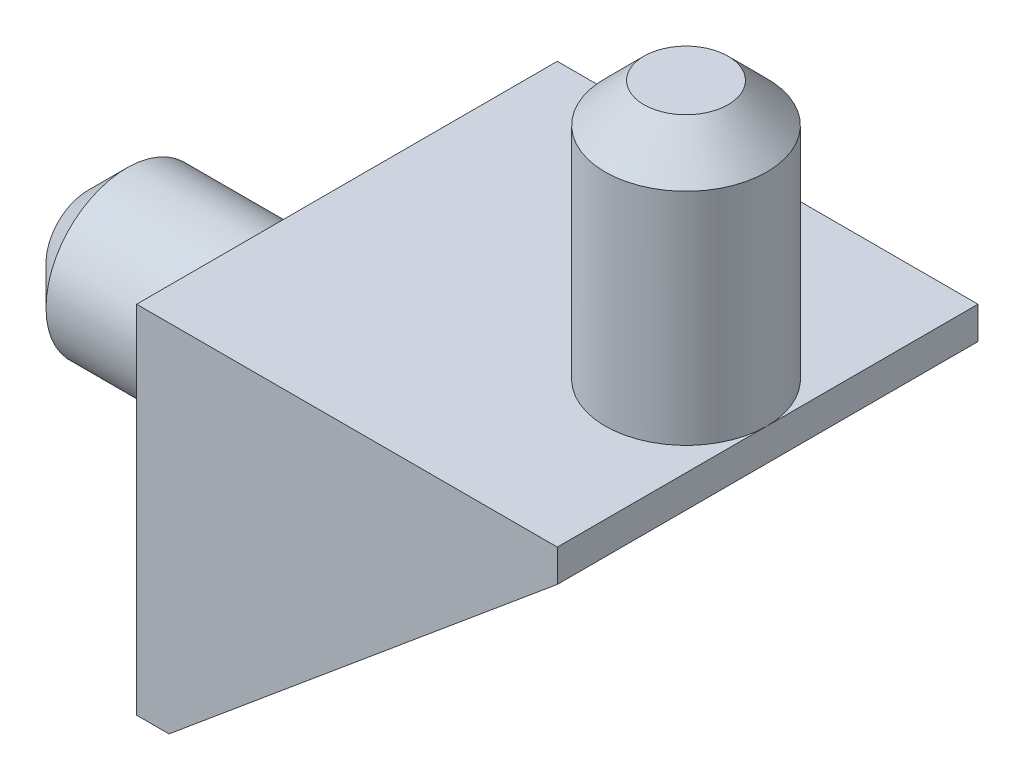
ISO-10303-21;
HEADER;
FILE_DESCRIPTION(('STEP AP214'),'2;1');
FILE_NAME('part.step','',(''),(''),'','','');
FILE_SCHEMA(('AUTOMOTIVE_DESIGN { 1 0 10303 214 1 1 1 1 }'));
ENDSEC;
DATA;
#1=APPLICATION_CONTEXT('core data for automotive mechanical design processes');
#2=APPLICATION_PROTOCOL_DEFINITION('international standard','automotive_design',2000,#1);
#3=PRODUCT_CONTEXT('',#1,'mechanical');
#4=PRODUCT('Part','Part','',(#3));
#5=PRODUCT_RELATED_PRODUCT_CATEGORY('part','',(#4));
#6=PRODUCT_DEFINITION_FORMATION('','',#4);
#7=PRODUCT_DEFINITION_CONTEXT('part definition',#1,'design');
#8=PRODUCT_DEFINITION('design','',#6,#7);
#9=PRODUCT_DEFINITION_SHAPE('','',#8);
#10=(LENGTH_UNIT() NAMED_UNIT(*) SI_UNIT(.MILLI.,.METRE.));
#11=(NAMED_UNIT(*) PLANE_ANGLE_UNIT() SI_UNIT($,.RADIAN.));
#12=(NAMED_UNIT(*) SI_UNIT($,.STERADIAN.) SOLID_ANGLE_UNIT());
#13=UNCERTAINTY_MEASURE_WITH_UNIT(LENGTH_MEASURE(1.E-05),#10,'distance_accuracy_value','');
#14=(GEOMETRIC_REPRESENTATION_CONTEXT(3) GLOBAL_UNCERTAINTY_ASSIGNED_CONTEXT((#13)) GLOBAL_UNIT_ASSIGNED_CONTEXT((#10,
#11,#12)) REPRESENTATION_CONTEXT('',''));
#15=CARTESIAN_POINT('',(0.,0.,0.));
#16=DIRECTION('',(0.,0.,1.));
#17=DIRECTION('',(1.,0.,0.));
#18=AXIS2_PLACEMENT_3D('',#15,#16,#17);
#19=CARTESIAN_POINT('',(-1.,0.,0.));
#20=DIRECTION('',(-1.,0.,0.));
#21=DIRECTION('',(0.,0.,1.));
#22=AXIS2_PLACEMENT_3D('',#19,#20,#21);
#23=PLANE('',#22);
#24=DIRECTION('',(0.,0.,-1.));
#25=VECTOR('',#24,1.);
#26=CARTESIAN_POINT('',(-1.,1.,0.));
#27=LINE('',#26,#25);
#28=CARTESIAN_POINT('',(-0.999999999999999,1.,12.));
#29=VERTEX_POINT('',#28);
#30=CARTESIAN_POINT('',(-1.,1.,-1.));
#31=VERTEX_POINT('',#30);
#32=EDGE_CURVE('E160',#29,#31,#27,.T.);
#33=ORIENTED_EDGE('',*,*,#32,.T.);
#34=DIRECTION('',(0.,1.,0.));
#35=VECTOR('',#34,1.);
#36=CARTESIAN_POINT('',(-1.,-10.,-1.));
#37=LINE('',#36,#35);
#38=CARTESIAN_POINT('',(-1.,-10.,-1.));
#39=VERTEX_POINT('',#38);
#40=EDGE_CURVE('E382',#39,#31,#37,.T.);
#41=ORIENTED_EDGE('',*,*,#40,.F.);
#42=DIRECTION('',(0.,0.,1.));
#43=VECTOR('',#42,1.);
#44=CARTESIAN_POINT('',(-1.,-10.,0.));
#45=LINE('',#44,#43);
#46=CARTESIAN_POINT('',(-0.999999999999999,-10.,12.));
#47=VERTEX_POINT('',#46);
#48=EDGE_CURVE('E158',#39,#47,#45,.T.);
#49=ORIENTED_EDGE('',*,*,#48,.T.);
#50=DIRECTION('',(0.,-1.,0.));
#51=VECTOR('',#50,1.);
#52=CARTESIAN_POINT('',(-0.999999999999999,1.,12.));
#53=LINE('',#52,#51);
#54=EDGE_CURVE('E143',#29,#47,#53,.T.);
#55=ORIENTED_EDGE('',*,*,#54,.F.);
#56=EDGE_LOOP('',(#33,#41,#49,#55));
#57=FACE_BOUND('',#56,.T.);
#58=CARTESIAN_POINT('',(-0.999999999999999,-4.5,5.5));
#59=DIRECTION('',(-1.,0.,0.));
#60=DIRECTION('',(0.,0.,1.));
#61=AXIS2_PLACEMENT_3D('',#58,#59,#60);
#62=CIRCLE('',#61,2.5);
#63=CARTESIAN_POINT('',(-0.999999999999999,-4.5,8.));
#64=VERTEX_POINT('',#63);
#65=EDGE_CURVE('E154',#64,#64,#62,.T.);
#66=ORIENTED_EDGE('',*,*,#65,.F.);
#67=EDGE_LOOP('',(#66));
#68=FACE_BOUND('',#67,.T.);
#69=ADVANCED_FACE('F33',(#57,#68),#23,.T.);
#70=CARTESIAN_POINT('',(12.,1.,0.));
#71=DIRECTION('',(-1.,0.,0.));
#72=DIRECTION('',(0.,0.,1.));
#73=AXIS2_PLACEMENT_3D('',#70,#71,#72);
#74=PLANE('',#73);
#75=DIRECTION('',(0.,0.,-1.));
#76=VECTOR('',#75,1.);
#77=CARTESIAN_POINT('',(12.,0.,0.));
#78=LINE('',#77,#76);
#79=CARTESIAN_POINT('',(12.,0.,11.));
#80=VERTEX_POINT('',#79);
#81=CARTESIAN_POINT('',(12.,0.,0.));
#82=VERTEX_POINT('',#81);
#83=EDGE_CURVE('E56',#80,#82,#78,.T.);
#84=ORIENTED_EDGE('',*,*,#83,.T.);
#85=DIRECTION('',(0.,0.,1.));
#86=VECTOR('',#85,1.);
#87=CARTESIAN_POINT('',(12.,0.,-1.));
#88=LINE('',#87,#86);
#89=CARTESIAN_POINT('',(12.,0.,-1.));
#90=VERTEX_POINT('',#89);
#91=EDGE_CURVE('E106',#90,#82,#88,.T.);
#92=ORIENTED_EDGE('',*,*,#91,.F.);
#93=DIRECTION('',(0.,-1.,0.));
#94=VECTOR('',#93,1.);
#95=CARTESIAN_POINT('',(12.,1.,-1.));
#96=LINE('',#95,#94);
#97=CARTESIAN_POINT('',(12.,1.,-1.));
#98=VERTEX_POINT('',#97);
#99=EDGE_CURVE('E113',#98,#90,#96,.T.);
#100=ORIENTED_EDGE('',*,*,#99,.F.);
#101=DIRECTION('',(0.,0.,-1.));
#102=VECTOR('',#101,1.);
#103=CARTESIAN_POINT('',(12.,1.,0.));
#104=LINE('',#103,#102);
#105=CARTESIAN_POINT('',(12.,1.,5.52302277930399));
#106=VERTEX_POINT('',#105);
#107=EDGE_CURVE('E176',#106,#98,#104,.T.);
#108=ORIENTED_EDGE('',*,*,#107,.F.);
#109=CARTESIAN_POINT('',(12.,1.,12.));
#110=VERTEX_POINT('',#109);
#111=EDGE_CURVE('E173',#110,#106,#104,.T.);
#112=ORIENTED_EDGE('',*,*,#111,.F.);
#113=DIRECTION('',(0.,1.,0.));
#114=VECTOR('',#113,1.);
#115=CARTESIAN_POINT('',(12.,0.,12.));
#116=LINE('',#115,#114);
#117=CARTESIAN_POINT('',(12.,0.,12.));
#118=VERTEX_POINT('',#117);
#119=EDGE_CURVE('E137',#118,#110,#116,.T.);
#120=ORIENTED_EDGE('',*,*,#119,.F.);
#121=DIRECTION('',(0.,0.,-1.));
#122=VECTOR('',#121,1.);
#123=CARTESIAN_POINT('',(12.,0.,12.));
#124=LINE('',#123,#122);
#125=EDGE_CURVE('E145',#118,#80,#124,.T.);
#126=ORIENTED_EDGE('',*,*,#125,.T.);
#127=EDGE_LOOP('',(#84,#92,#100,#108,#112,#120,#126));
#128=FACE_BOUND('',#127,.T.);
#129=ADVANCED_FACE('F124',(#128),#74,.F.);
#130=CARTESIAN_POINT('',(0.,1.,0.));
#131=DIRECTION('',(0.,1.,0.));
#132=DIRECTION('',(0.,0.,1.));
#133=AXIS2_PLACEMENT_3D('',#130,#131,#132);
#134=PLANE('',#133);
#135=ORIENTED_EDGE('',*,*,#111,.T.);
#136=CARTESIAN_POINT('',(9.5,1.,5.52302277930399));
#137=DIRECTION('',(0.,1.,0.));
#138=DIRECTION('',(0.,0.,1.));
#139=AXIS2_PLACEMENT_3D('',#136,#137,#138);
#140=CIRCLE('',#139,2.5);
#141=EDGE_CURVE('E151',#106,#106,#140,.T.);
#142=ORIENTED_EDGE('',*,*,#141,.F.);
#143=ORIENTED_EDGE('',*,*,#107,.T.);
#144=DIRECTION('',(1.,0.,0.));
#145=VECTOR('',#144,1.);
#146=CARTESIAN_POINT('',(-1.,1.,-1.));
#147=LINE('',#146,#145);
#148=EDGE_CURVE('E120',#31,#98,#147,.T.);
#149=ORIENTED_EDGE('',*,*,#148,.F.);
#150=ORIENTED_EDGE('',*,*,#32,.F.);
#151=DIRECTION('',(-1.,0.,0.));
#152=VECTOR('',#151,1.);
#153=CARTESIAN_POINT('',(12.,1.,12.));
#154=LINE('',#153,#152);
#155=EDGE_CURVE('E140',#110,#29,#154,.T.);
#156=ORIENTED_EDGE('',*,*,#155,.F.);
#157=EDGE_LOOP('',(#135,#142,#143,#149,#150,#156));
#158=FACE_BOUND('',#157,.T.);
#159=ADVANCED_FACE('F219',(#158),#134,.T.);
#160=CARTESIAN_POINT('',(0.,0.,0.));
#161=DIRECTION('',(0.,1.,0.));
#162=DIRECTION('',(0.,0.,1.));
#163=AXIS2_PLACEMENT_3D('',#160,#161,#162);
#164=PLANE('',#163);
#165=DIRECTION('',(0.,0.,1.));
#166=VECTOR('',#165,1.);
#167=CARTESIAN_POINT('',(0.,0.,0.));
#168=LINE('',#167,#166);
#169=CARTESIAN_POINT('',(0.,0.,0.));
#170=VERTEX_POINT('',#169);
#171=CARTESIAN_POINT('',(0.,0.,11.));
#172=VERTEX_POINT('',#171);
#173=EDGE_CURVE('E48',#170,#172,#168,.T.);
#174=ORIENTED_EDGE('',*,*,#173,.F.);
#175=DIRECTION('',(-1.,0.,0.));
#176=VECTOR('',#175,1.);
#177=CARTESIAN_POINT('',(0.,0.,0.));
#178=LINE('',#177,#176);
#179=EDGE_CURVE('E186',#82,#170,#178,.T.);
#180=ORIENTED_EDGE('',*,*,#179,.F.);
#181=ORIENTED_EDGE('',*,*,#83,.F.);
#182=DIRECTION('',(1.,0.,0.));
#183=VECTOR('',#182,1.);
#184=CARTESIAN_POINT('',(0.,0.,11.));
#185=LINE('',#184,#183);
#186=EDGE_CURVE('E181',#172,#80,#185,.T.);
#187=ORIENTED_EDGE('',*,*,#186,.F.);
#188=EDGE_LOOP('',(#174,#180,#181,#187));
#189=FACE_BOUND('',#188,.T.);
#190=ADVANCED_FACE('F230',(#189),#164,.F.);
#191=CARTESIAN_POINT('',(0.,0.,0.));
#192=DIRECTION('',(-1.,0.,0.));
#193=DIRECTION('',(0.,0.,1.));
#194=AXIS2_PLACEMENT_3D('',#191,#192,#193);
#195=PLANE('',#194);
#196=DIRECTION('',(0.,-1.,0.));
#197=VECTOR('',#196,1.);
#198=CARTESIAN_POINT('',(0.,1.,0.));
#199=LINE('',#198,#197);
#200=CARTESIAN_POINT('',(0.,-10.,0.));
#201=VERTEX_POINT('',#200);
#202=EDGE_CURVE('E157',#170,#201,#199,.T.);
#203=ORIENTED_EDGE('',*,*,#202,.F.);
#204=ORIENTED_EDGE('',*,*,#173,.T.);
#205=DIRECTION('',(0.,1.,0.));
#206=VECTOR('',#205,1.);
#207=CARTESIAN_POINT('',(0.,1.,11.));
#208=LINE('',#207,#206);
#209=CARTESIAN_POINT('',(0.,-10.,11.));
#210=VERTEX_POINT('',#209);
#211=EDGE_CURVE('E161',#210,#172,#208,.T.);
#212=ORIENTED_EDGE('',*,*,#211,.F.);
#213=DIRECTION('',(0.,0.,1.));
#214=VECTOR('',#213,1.);
#215=CARTESIAN_POINT('',(0.,-10.,0.));
#216=LINE('',#215,#214);
#217=EDGE_CURVE('E165',#201,#210,#216,.T.);
#218=ORIENTED_EDGE('',*,*,#217,.F.);
#219=EDGE_LOOP('',(#203,#204,#212,#218));
#220=FACE_BOUND('',#219,.T.);
#221=ADVANCED_FACE('F226',(#220),#195,.F.);
#222=CARTESIAN_POINT('',(-1.,-10.,0.));
#223=DIRECTION('',(0.,1.,0.));
#224=DIRECTION('',(0.,0.,1.));
#225=AXIS2_PLACEMENT_3D('',#222,#223,#224);
#226=PLANE('',#225);
#227=ORIENTED_EDGE('',*,*,#217,.T.);
#228=DIRECTION('',(0.,0.,-1.));
#229=VECTOR('',#228,1.);
#230=CARTESIAN_POINT('',(0.,-10.,12.));
#231=LINE('',#230,#229);
#232=CARTESIAN_POINT('',(0.,-10.,12.));
#233=VERTEX_POINT('',#232);
#234=EDGE_CURVE('E148',#233,#210,#231,.T.);
#235=ORIENTED_EDGE('',*,*,#234,.F.);
#236=DIRECTION('',(1.,0.,0.));
#237=VECTOR('',#236,1.);
#238=CARTESIAN_POINT('',(-0.999999999999999,-10.,12.));
#239=LINE('',#238,#237);
#240=EDGE_CURVE('E128',#47,#233,#239,.T.);
#241=ORIENTED_EDGE('',*,*,#240,.F.);
#242=ORIENTED_EDGE('',*,*,#48,.F.);
#243=DIRECTION('',(-1.,0.,0.));
#244=VECTOR('',#243,1.);
#245=CARTESIAN_POINT('',(0.,-10.,-1.));
#246=LINE('',#245,#244);
#247=CARTESIAN_POINT('',(0.,-10.,-1.));
#248=VERTEX_POINT('',#247);
#249=EDGE_CURVE('E112',#248,#39,#246,.T.);
#250=ORIENTED_EDGE('',*,*,#249,.F.);
#251=DIRECTION('',(0.,0.,1.));
#252=VECTOR('',#251,1.);
#253=CARTESIAN_POINT('',(0.,-10.,-1.));
#254=LINE('',#253,#252);
#255=EDGE_CURVE('E108',#248,#201,#254,.T.);
#256=ORIENTED_EDGE('',*,*,#255,.T.);
#257=EDGE_LOOP('',(#227,#235,#241,#242,#250,#256));
#258=FACE_BOUND('',#257,.T.);
#259=ADVANCED_FACE('F229',(#258),#226,.F.);
#260=CARTESIAN_POINT('',(-9.,-4.5,5.5));
#261=DIRECTION('',(1.,0.,0.));
#262=DIRECTION('',(0.,0.,-1.));
#263=AXIS2_PLACEMENT_3D('',#260,#261,#262);
#264=CYLINDRICAL_SURFACE('',#263,2.5);
#265=CARTESIAN_POINT('',(-7.79999999999999,-4.5,5.5));
#266=DIRECTION('',(-1.,0.,0.));
#267=DIRECTION('',(0.,0.,1.));
#268=AXIS2_PLACEMENT_3D('',#265,#266,#267);
#269=CIRCLE('',#268,2.5);
#270=CARTESIAN_POINT('',(-7.79999999999999,-4.5,8.));
#271=VERTEX_POINT('',#270);
#272=EDGE_CURVE('E193',#271,#271,#269,.F.);
#273=ORIENTED_EDGE('',*,*,#272,.T.);
#274=EDGE_LOOP('',(#273));
#275=FACE_BOUND('',#274,.T.);
#276=ORIENTED_EDGE('',*,*,#65,.T.);
#277=EDGE_LOOP('',(#276));
#278=FACE_BOUND('',#277,.T.);
#279=ADVANCED_FACE('F224',(#275,#278),#264,.T.);
#280=CARTESIAN_POINT('',(-9.,-4.5,5.5));
#281=DIRECTION('',(-1.,0.,0.));
#282=DIRECTION('',(0.,0.,1.));
#283=AXIS2_PLACEMENT_3D('',#280,#281,#282);
#284=PLANE('',#283);
#285=CARTESIAN_POINT('',(-9.,-4.5,5.5));
#286=DIRECTION('',(-1.,0.,0.));
#287=DIRECTION('',(0.,0.,1.));
#288=AXIS2_PLACEMENT_3D('',#285,#286,#287);
#289=CIRCLE('',#288,1.3);
#290=CARTESIAN_POINT('',(-9.,-4.5,6.8));
#291=VERTEX_POINT('',#290);
#292=EDGE_CURVE('E175',#291,#291,#289,.T.);
#293=ORIENTED_EDGE('',*,*,#292,.T.);
#294=EDGE_LOOP('',(#293));
#295=FACE_BOUND('',#294,.T.);
#296=ADVANCED_FACE('F241',(#295),#284,.T.);
#297=CARTESIAN_POINT('',(-9.,-4.5,5.5));
#298=DIRECTION('',(1.,0.,0.));
#299=DIRECTION('',(0.,0.,-1.));
#300=AXIS2_PLACEMENT_3D('',#297,#298,#299);
#301=CONICAL_SURFACE('',#300,1.3,0.785398163397446);
#302=ORIENTED_EDGE('',*,*,#272,.F.);
#303=EDGE_LOOP('',(#302));
#304=FACE_BOUND('',#303,.T.);
#305=ORIENTED_EDGE('',*,*,#292,.F.);
#306=EDGE_LOOP('',(#305));
#307=FACE_BOUND('',#306,.T.);
#308=ADVANCED_FACE('F239',(#304,#307),#301,.T.);
#309=CARTESIAN_POINT('',(9.5,9.,5.52302277930399));
#310=DIRECTION('',(0.,-1.,0.));
#311=DIRECTION('',(0.,0.,-1.));
#312=AXIS2_PLACEMENT_3D('',#309,#310,#311);
#313=CYLINDRICAL_SURFACE('',#312,2.5);
#314=CARTESIAN_POINT('',(9.5,7.8,5.52302277930399));
#315=DIRECTION('',(0.,1.,0.));
#316=DIRECTION('',(0.,0.,1.));
#317=AXIS2_PLACEMENT_3D('',#314,#315,#316);
#318=CIRCLE('',#317,2.5);
#319=CARTESIAN_POINT('',(9.5,7.8,8.02302277930399));
#320=VERTEX_POINT('',#319);
#321=EDGE_CURVE('E11',#320,#320,#318,.F.);
#322=ORIENTED_EDGE('',*,*,#321,.T.);
#323=EDGE_LOOP('',(#322));
#324=FACE_BOUND('',#323,.T.);
#325=ORIENTED_EDGE('',*,*,#141,.T.);
#326=EDGE_LOOP('',(#325));
#327=FACE_BOUND('',#326,.T.);
#328=ADVANCED_FACE('F210',(#324,#327),#313,.T.);
#329=CARTESIAN_POINT('',(9.5,9.,5.52302277930399));
#330=DIRECTION('',(0.,1.,0.));
#331=DIRECTION('',(0.,0.,1.));
#332=AXIS2_PLACEMENT_3D('',#329,#330,#331);
#333=PLANE('',#332);
#334=CARTESIAN_POINT('',(9.5,9.,5.52302277930399));
#335=DIRECTION('',(0.,1.,0.));
#336=DIRECTION('',(0.,0.,1.));
#337=AXIS2_PLACEMENT_3D('',#334,#335,#336);
#338=CIRCLE('',#337,1.3);
#339=CARTESIAN_POINT('',(9.5,9.,6.82302277930399));
#340=VERTEX_POINT('',#339);
#341=EDGE_CURVE('E41',#340,#340,#338,.T.);
#342=ORIENTED_EDGE('',*,*,#341,.T.);
#343=EDGE_LOOP('',(#342));
#344=FACE_BOUND('',#343,.T.);
#345=ADVANCED_FACE('F198',(#344),#333,.T.);
#346=CARTESIAN_POINT('',(9.5,9.,5.52302277930399));
#347=DIRECTION('',(0.,-1.,0.));
#348=DIRECTION('',(0.,0.,-1.));
#349=AXIS2_PLACEMENT_3D('',#346,#347,#348);
#350=CONICAL_SURFACE('',#349,1.3,0.785398163397447);
#351=ORIENTED_EDGE('',*,*,#321,.F.);
#352=EDGE_LOOP('',(#351));
#353=FACE_BOUND('',#352,.T.);
#354=ORIENTED_EDGE('',*,*,#341,.F.);
#355=EDGE_LOOP('',(#354));
#356=FACE_BOUND('',#355,.T.);
#357=ADVANCED_FACE('F35',(#353,#356),#350,.T.);
#358=CARTESIAN_POINT('',(0.,0.,11.));
#359=DIRECTION('',(0.,0.,1.));
#360=DIRECTION('',(1.,0.,0.));
#361=AXIS2_PLACEMENT_3D('',#358,#359,#360);
#362=PLANE('',#361);
#363=ORIENTED_EDGE('',*,*,#211,.T.);
#364=ORIENTED_EDGE('',*,*,#186,.T.);
#365=DIRECTION('',(0.768221279597376,0.64018439966448,0.));
#366=VECTOR('',#365,1.);
#367=CARTESIAN_POINT('',(0.,-10.,11.));
#368=LINE('',#367,#366);
#369=EDGE_CURVE('E125',#210,#80,#368,.T.);
#370=ORIENTED_EDGE('',*,*,#369,.F.);
#371=EDGE_LOOP('',(#363,#364,#370));
#372=FACE_BOUND('',#371,.T.);
#373=ADVANCED_FACE('F201',(#372),#362,.F.);
#374=CARTESIAN_POINT('',(0.,-10.,12.));
#375=DIRECTION('',(-0.64018439966448,0.768221279597376,0.));
#376=DIRECTION('',(-0.768221279597376,-0.64018439966448,0.));
#377=AXIS2_PLACEMENT_3D('',#374,#375,#376);
#378=PLANE('',#377);
#379=ORIENTED_EDGE('',*,*,#369,.T.);
#380=ORIENTED_EDGE('',*,*,#125,.F.);
#381=DIRECTION('',(0.768221279597376,0.64018439966448,0.));
#382=VECTOR('',#381,1.);
#383=CARTESIAN_POINT('',(0.,-10.,12.));
#384=LINE('',#383,#382);
#385=EDGE_CURVE('E135',#233,#118,#384,.T.);
#386=ORIENTED_EDGE('',*,*,#385,.F.);
#387=ORIENTED_EDGE('',*,*,#234,.T.);
#388=EDGE_LOOP('',(#379,#380,#386,#387));
#389=FACE_BOUND('',#388,.T.);
#390=ADVANCED_FACE('F207',(#389),#378,.F.);
#391=CARTESIAN_POINT('',(0.,0.,12.));
#392=DIRECTION('',(0.,0.,1.));
#393=DIRECTION('',(1.,0.,0.));
#394=AXIS2_PLACEMENT_3D('',#391,#392,#393);
#395=PLANE('',#394);
#396=ORIENTED_EDGE('',*,*,#240,.T.);
#397=ORIENTED_EDGE('',*,*,#385,.T.);
#398=ORIENTED_EDGE('',*,*,#119,.T.);
#399=ORIENTED_EDGE('',*,*,#155,.T.);
#400=ORIENTED_EDGE('',*,*,#54,.T.);
#401=EDGE_LOOP('',(#396,#397,#398,#399,#400));
#402=FACE_BOUND('',#401,.T.);
#403=ADVANCED_FACE('F302',(#402),#395,.T.);
#404=CARTESIAN_POINT('',(0.,0.,0.));
#405=DIRECTION('',(0.,0.,-1.));
#406=DIRECTION('',(-1.,0.,0.));
#407=AXIS2_PLACEMENT_3D('',#404,#405,#406);
#408=PLANE('',#407);
#409=DIRECTION('',(-0.768221279597376,-0.64018439966448,0.));
#410=VECTOR('',#409,1.);
#411=CARTESIAN_POINT('',(12.,0.,0.));
#412=LINE('',#411,#410);
#413=EDGE_CURVE('E122',#82,#201,#412,.T.);
#414=ORIENTED_EDGE('',*,*,#413,.F.);
#415=ORIENTED_EDGE('',*,*,#179,.T.);
#416=ORIENTED_EDGE('',*,*,#202,.T.);
#417=EDGE_LOOP('',(#414,#415,#416));
#418=FACE_BOUND('',#417,.T.);
#419=ADVANCED_FACE('F311',(#418),#408,.F.);
#420=CARTESIAN_POINT('',(12.,0.,-1.));
#421=DIRECTION('',(-0.64018439966448,0.768221279597376,0.));
#422=DIRECTION('',(-0.768221279597376,-0.64018439966448,0.));
#423=AXIS2_PLACEMENT_3D('',#420,#421,#422);
#424=PLANE('',#423);
#425=ORIENTED_EDGE('',*,*,#413,.T.);
#426=ORIENTED_EDGE('',*,*,#255,.F.);
#427=DIRECTION('',(-0.768221279597376,-0.64018439966448,0.));
#428=VECTOR('',#427,1.);
#429=CARTESIAN_POINT('',(12.,0.,-1.));
#430=LINE('',#429,#428);
#431=EDGE_CURVE('E102',#90,#248,#430,.T.);
#432=ORIENTED_EDGE('',*,*,#431,.F.);
#433=ORIENTED_EDGE('',*,*,#91,.T.);
#434=EDGE_LOOP('',(#425,#426,#432,#433));
#435=FACE_BOUND('',#434,.T.);
#436=ADVANCED_FACE('F105',(#435),#424,.F.);
#437=CARTESIAN_POINT('',(0.,0.,-1.));
#438=DIRECTION('',(0.,0.,-1.));
#439=DIRECTION('',(-1.,0.,0.));
#440=AXIS2_PLACEMENT_3D('',#437,#438,#439);
#441=PLANE('',#440);
#442=ORIENTED_EDGE('',*,*,#99,.T.);
#443=ORIENTED_EDGE('',*,*,#431,.T.);
#444=ORIENTED_EDGE('',*,*,#249,.T.);
#445=ORIENTED_EDGE('',*,*,#40,.T.);
#446=ORIENTED_EDGE('',*,*,#148,.T.);
#447=EDGE_LOOP('',(#442,#443,#444,#445,#446));
#448=FACE_BOUND('',#447,.T.);
#449=ADVANCED_FACE('F117',(#448),#441,.T.);
#450=CLOSED_SHELL('',(#69,#129,#159,#190,#221,#259,#279,#296,#308,#328,#345,#357,#373,#390,#403,
#419,#436,#449));
#451=MANIFOLD_SOLID_BREP('B2',#450);
#452=ADVANCED_BREP_SHAPE_REPRESENTATION('',(#18,#451),#14);
#453=SHAPE_DEFINITION_REPRESENTATION(#9,#452);
ENDSEC;
END-ISO-10303-21;
